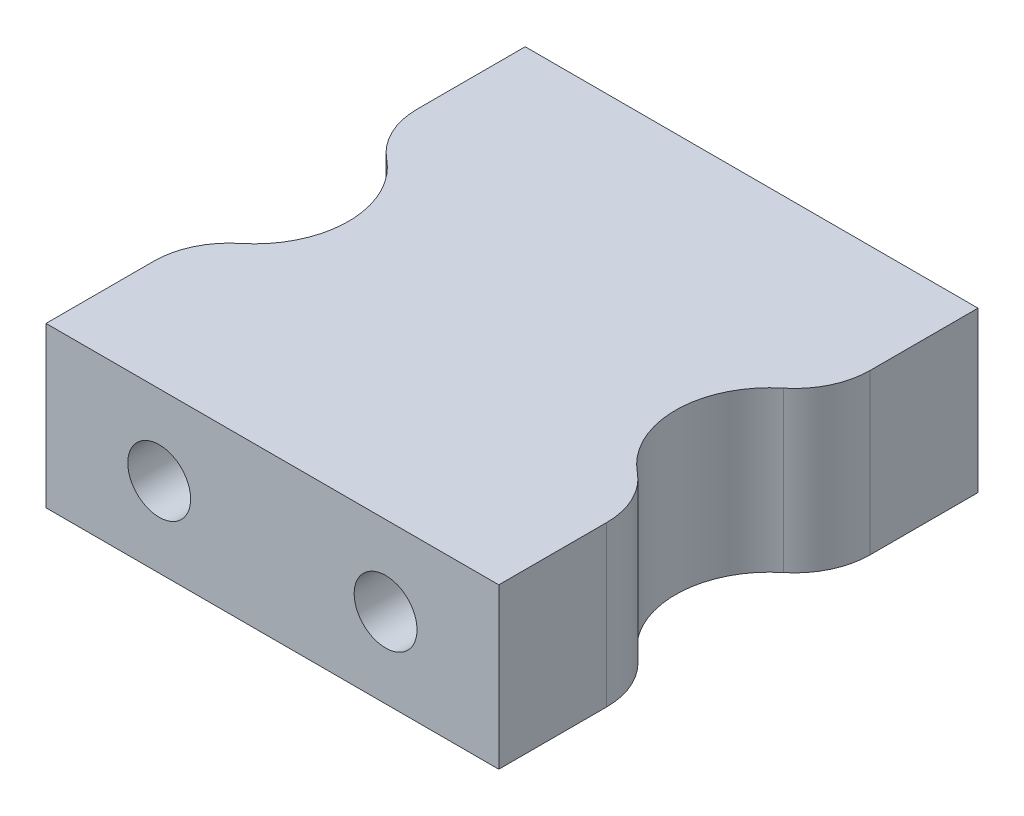
ISO-10303-21;
HEADER;
FILE_DESCRIPTION(('STEP AP214'),'2;1');
FILE_NAME('part.step','',(''),(''),'','','');
FILE_SCHEMA(('AUTOMOTIVE_DESIGN { 1 0 10303 214 1 1 1 1 }'));
ENDSEC;
DATA;
#1=APPLICATION_CONTEXT('core data for automotive mechanical design processes');
#2=APPLICATION_PROTOCOL_DEFINITION('international standard','automotive_design',2000,#1);
#3=PRODUCT_CONTEXT('',#1,'mechanical');
#4=PRODUCT('Part','Part','',(#3));
#5=PRODUCT_RELATED_PRODUCT_CATEGORY('part','',(#4));
#6=PRODUCT_DEFINITION_FORMATION('','',#4);
#7=PRODUCT_DEFINITION_CONTEXT('part definition',#1,'design');
#8=PRODUCT_DEFINITION('design','',#6,#7);
#9=PRODUCT_DEFINITION_SHAPE('','',#8);
#10=(LENGTH_UNIT() NAMED_UNIT(*) SI_UNIT(.MILLI.,.METRE.));
#11=(NAMED_UNIT(*) PLANE_ANGLE_UNIT() SI_UNIT($,.RADIAN.));
#12=(NAMED_UNIT(*) SI_UNIT($,.STERADIAN.) SOLID_ANGLE_UNIT());
#13=UNCERTAINTY_MEASURE_WITH_UNIT(LENGTH_MEASURE(1.E-05),#10,'distance_accuracy_value','');
#14=(GEOMETRIC_REPRESENTATION_CONTEXT(3) GLOBAL_UNCERTAINTY_ASSIGNED_CONTEXT((#13)) GLOBAL_UNIT_ASSIGNED_CONTEXT((#10,
#11,#12)) REPRESENTATION_CONTEXT('',''));
#15=CARTESIAN_POINT('',(0.,0.,0.));
#16=DIRECTION('',(0.,0.,1.));
#17=DIRECTION('',(1.,0.,0.));
#18=AXIS2_PLACEMENT_3D('',#15,#16,#17);
#19=CARTESIAN_POINT('',(0.,0.,19.05));
#20=DIRECTION('',(1.,0.,0.));
#21=DIRECTION('',(0.,1.,0.));
#22=AXIS2_PLACEMENT_3D('',#19,#20,#21);
#23=PLANE('',#22);
#24=DIRECTION('',(0.,0.,-1.));
#25=VECTOR('',#24,1.);
#26=CARTESIAN_POINT('',(0.,0.,19.05));
#27=LINE('',#26,#25);
#28=CARTESIAN_POINT('',(0.,0.,4.28805193839007));
#29=VERTEX_POINT('',#28);
#30=CARTESIAN_POINT('',(0.,0.,0.));
#31=VERTEX_POINT('',#30);
#32=EDGE_CURVE('E169',#29,#31,#27,.T.);
#33=ORIENTED_EDGE('',*,*,#32,.F.);
#34=DIRECTION('',(0.,1.,0.));
#35=VECTOR('',#34,1.);
#36=CARTESIAN_POINT('',(0.,0.,4.28805193839007));
#37=LINE('',#36,#35);
#38=CARTESIAN_POINT('',(0.,6.35,4.28805193839007));
#39=VERTEX_POINT('',#38);
#40=EDGE_CURVE('E11',#29,#39,#37,.T.);
#41=ORIENTED_EDGE('',*,*,#40,.T.);
#42=DIRECTION('',(0.,0.,-1.));
#43=VECTOR('',#42,1.);
#44=CARTESIAN_POINT('',(0.,6.35,19.05));
#45=LINE('',#44,#43);
#46=CARTESIAN_POINT('',(0.,6.35,0.));
#47=VERTEX_POINT('',#46);
#48=EDGE_CURVE('E243',#39,#47,#45,.T.);
#49=ORIENTED_EDGE('',*,*,#48,.T.);
#50=DIRECTION('',(0.,-1.,0.));
#51=VECTOR('',#50,1.);
#52=CARTESIAN_POINT('',(0.,0.,0.));
#53=LINE('',#52,#51);
#54=EDGE_CURVE('E244',#47,#31,#53,.T.);
#55=ORIENTED_EDGE('',*,*,#54,.T.);
#56=EDGE_LOOP('',(#33,#41,#49,#55));
#57=FACE_BOUND('',#56,.T.);
#58=ADVANCED_FACE('F49',(#57),#23,.F.);
#59=CARTESIAN_POINT('',(18.,0.,19.05));
#60=DIRECTION('',(-1.,0.,0.));
#61=DIRECTION('',(0.,0.,1.));
#62=AXIS2_PLACEMENT_3D('',#59,#60,#61);
#63=PLANE('',#62);
#64=DIRECTION('',(0.,0.,-1.));
#65=VECTOR('',#64,1.);
#66=CARTESIAN_POINT('',(18.,0.,19.05));
#67=LINE('',#66,#65);
#68=CARTESIAN_POINT('',(18.,0.,19.05));
#69=VERTEX_POINT('',#68);
#70=CARTESIAN_POINT('',(18.,0.,14.7619480616099));
#71=VERTEX_POINT('',#70);
#72=EDGE_CURVE('E148',#69,#71,#67,.T.);
#73=ORIENTED_EDGE('',*,*,#72,.T.);
#74=DIRECTION('',(0.,1.,0.));
#75=VECTOR('',#74,1.);
#76=CARTESIAN_POINT('',(18.,0.,14.7619480616099));
#77=LINE('',#76,#75);
#78=CARTESIAN_POINT('',(18.,6.35,14.7619480616099));
#79=VERTEX_POINT('',#78);
#80=EDGE_CURVE('E168',#71,#79,#77,.T.);
#81=ORIENTED_EDGE('',*,*,#80,.T.);
#82=DIRECTION('',(0.,0.,-1.));
#83=VECTOR('',#82,1.);
#84=CARTESIAN_POINT('',(18.,6.35,19.05));
#85=LINE('',#84,#83);
#86=CARTESIAN_POINT('',(18.,6.35,19.05));
#87=VERTEX_POINT('',#86);
#88=EDGE_CURVE('E262',#87,#79,#85,.T.);
#89=ORIENTED_EDGE('',*,*,#88,.F.);
#90=DIRECTION('',(0.,1.,0.));
#91=VECTOR('',#90,1.);
#92=CARTESIAN_POINT('',(18.,0.,19.05));
#93=LINE('',#92,#91);
#94=EDGE_CURVE('E152',#69,#87,#93,.T.);
#95=ORIENTED_EDGE('',*,*,#94,.F.);
#96=EDGE_LOOP('',(#73,#81,#89,#95));
#97=FACE_BOUND('',#96,.T.);
#98=ADVANCED_FACE('F338',(#97),#63,.F.);
#99=CARTESIAN_POINT('',(0.,6.35,19.05));
#100=VERTEX_POINT('',#99);
#101=CARTESIAN_POINT('',(0.,6.35,14.7619480616099));
#102=VERTEX_POINT('',#101);
#103=EDGE_CURVE('E259',#100,#102,#45,.T.);
#104=ORIENTED_EDGE('',*,*,#103,.T.);
#105=DIRECTION('',(0.,1.,0.));
#106=VECTOR('',#105,1.);
#107=CARTESIAN_POINT('',(0.,0.,14.7619480616099));
#108=LINE('',#107,#106);
#109=CARTESIAN_POINT('',(0.,0.,14.7619480616099));
#110=VERTEX_POINT('',#109);
#111=EDGE_CURVE('E58',#102,#110,#108,.F.);
#112=ORIENTED_EDGE('',*,*,#111,.T.);
#113=CARTESIAN_POINT('',(0.,0.,19.05));
#114=VERTEX_POINT('',#113);
#115=EDGE_CURVE('E145',#114,#110,#27,.T.);
#116=ORIENTED_EDGE('',*,*,#115,.F.);
#117=DIRECTION('',(0.,-1.,0.));
#118=VECTOR('',#117,1.);
#119=CARTESIAN_POINT('',(0.,0.,19.05));
#120=LINE('',#119,#118);
#121=EDGE_CURVE('E153',#100,#114,#120,.T.);
#122=ORIENTED_EDGE('',*,*,#121,.F.);
#123=EDGE_LOOP('',(#104,#112,#116,#122));
#124=FACE_BOUND('',#123,.T.);
#125=ADVANCED_FACE('F165',(#124),#23,.F.);
#126=CARTESIAN_POINT('',(0.,0.,19.05));
#127=DIRECTION('',(0.,1.,0.));
#128=DIRECTION('',(0.,0.,1.));
#129=AXIS2_PLACEMENT_3D('',#126,#127,#128);
#130=PLANE('',#129);
#131=CARTESIAN_POINT('',(19.235125,0.,9.525));
#132=DIRECTION('',(0.,1.,0.));
#133=DIRECTION('',(1.,0.,0.));
#134=AXIS2_PLACEMENT_3D('',#131,#132,#133);
#135=CIRCLE('',#134,3.735125);
#136=CARTESIAN_POINT('',(16.8864349214009,0.,6.62072493032857));
#137=VERTEX_POINT('',#136);
#138=CARTESIAN_POINT('',(16.8864349214009,0.,12.4292750696714));
#139=VERTEX_POINT('',#138);
#140=EDGE_CURVE('E233',#137,#139,#135,.T.);
#141=ORIENTED_EDGE('',*,*,#140,.T.);
#142=CARTESIAN_POINT('',(15.,0.,14.7619480616099));
#143=DIRECTION('',(0.,1.,0.));
#144=DIRECTION('',(0.,0.,1.));
#145=AXIS2_PLACEMENT_3D('',#142,#143,#144);
#146=CIRCLE('',#145,3.);
#147=EDGE_CURVE('E205',#139,#71,#146,.F.);
#148=ORIENTED_EDGE('',*,*,#147,.T.);
#149=ORIENTED_EDGE('',*,*,#72,.F.);
#150=DIRECTION('',(1.,0.,0.));
#151=VECTOR('',#150,1.);
#152=CARTESIAN_POINT('',(0.,0.,19.05));
#153=LINE('',#152,#151);
#154=EDGE_CURVE('E140',#114,#69,#153,.T.);
#155=ORIENTED_EDGE('',*,*,#154,.F.);
#156=ORIENTED_EDGE('',*,*,#115,.T.);
#157=CARTESIAN_POINT('',(3.,0.,14.7619480616099));
#158=DIRECTION('',(0.,1.,0.));
#159=DIRECTION('',(0.,0.,1.));
#160=AXIS2_PLACEMENT_3D('',#157,#158,#159);
#161=CIRCLE('',#160,3.);
#162=CARTESIAN_POINT('',(1.11356507859914,0.,12.4292750696714));
#163=VERTEX_POINT('',#162);
#164=EDGE_CURVE('E199',#110,#163,#161,.F.);
#165=ORIENTED_EDGE('',*,*,#164,.T.);
#166=CARTESIAN_POINT('',(-1.235125,0.,9.525));
#167=DIRECTION('',(0.,1.,0.));
#168=DIRECTION('',(-1.,0.,0.));
#169=AXIS2_PLACEMENT_3D('',#166,#167,#168);
#170=CIRCLE('',#169,3.735125);
#171=CARTESIAN_POINT('',(1.11356507859914,0.,6.62072493032857));
#172=VERTEX_POINT('',#171);
#173=EDGE_CURVE('E221',#163,#172,#170,.T.);
#174=ORIENTED_EDGE('',*,*,#173,.T.);
#175=CARTESIAN_POINT('',(3.,0.,4.28805193839007));
#176=DIRECTION('',(0.,1.,0.));
#177=DIRECTION('',(0.,0.,1.));
#178=AXIS2_PLACEMENT_3D('',#175,#176,#177);
#179=CIRCLE('',#178,3.);
#180=EDGE_CURVE('E65',#172,#29,#179,.F.);
#181=ORIENTED_EDGE('',*,*,#180,.T.);
#182=ORIENTED_EDGE('',*,*,#32,.T.);
#183=DIRECTION('',(1.,0.,0.));
#184=VECTOR('',#183,1.);
#185=CARTESIAN_POINT('',(0.,0.,0.));
#186=LINE('',#185,#184);
#187=CARTESIAN_POINT('',(18.,0.,0.));
#188=VERTEX_POINT('',#187);
#189=EDGE_CURVE('E248',#31,#188,#186,.T.);
#190=ORIENTED_EDGE('',*,*,#189,.T.);
#191=CARTESIAN_POINT('',(18.,0.,4.28805193839007));
#192=VERTEX_POINT('',#191);
#193=EDGE_CURVE('E264',#192,#188,#67,.T.);
#194=ORIENTED_EDGE('',*,*,#193,.F.);
#195=CARTESIAN_POINT('',(15.,0.,4.28805193839007));
#196=DIRECTION('',(0.,1.,0.));
#197=DIRECTION('',(0.,0.,1.));
#198=AXIS2_PLACEMENT_3D('',#195,#196,#197);
#199=CIRCLE('',#198,3.);
#200=EDGE_CURVE('E202',#192,#137,#199,.F.);
#201=ORIENTED_EDGE('',*,*,#200,.T.);
#202=EDGE_LOOP('',(#141,#148,#149,#155,#156,#165,#174,#181,#182,#190,#194,#201));
#203=FACE_BOUND('',#202,.T.);
#204=ADVANCED_FACE('F143',(#203),#130,.F.);
#205=CARTESIAN_POINT('',(18.,6.35,4.28805193839007));
#206=VERTEX_POINT('',#205);
#207=CARTESIAN_POINT('',(18.,6.35,0.));
#208=VERTEX_POINT('',#207);
#209=EDGE_CURVE('E261',#206,#208,#85,.T.);
#210=ORIENTED_EDGE('',*,*,#209,.F.);
#211=DIRECTION('',(0.,1.,0.));
#212=VECTOR('',#211,1.);
#213=CARTESIAN_POINT('',(18.,0.,4.28805193839007));
#214=LINE('',#213,#212);
#215=EDGE_CURVE('E208',#206,#192,#214,.F.);
#216=ORIENTED_EDGE('',*,*,#215,.T.);
#217=ORIENTED_EDGE('',*,*,#193,.T.);
#218=DIRECTION('',(0.,1.,0.));
#219=VECTOR('',#218,1.);
#220=CARTESIAN_POINT('',(18.,0.,0.));
#221=LINE('',#220,#219);
#222=EDGE_CURVE('E252',#188,#208,#221,.T.);
#223=ORIENTED_EDGE('',*,*,#222,.T.);
#224=EDGE_LOOP('',(#210,#216,#217,#223));
#225=FACE_BOUND('',#224,.T.);
#226=ADVANCED_FACE('F275',(#225),#63,.F.);
#227=CARTESIAN_POINT('',(0.,6.35,19.05));
#228=DIRECTION('',(0.,-1.,0.));
#229=DIRECTION('',(0.,0.,-1.));
#230=AXIS2_PLACEMENT_3D('',#227,#228,#229);
#231=PLANE('',#230);
#232=ORIENTED_EDGE('',*,*,#88,.T.);
#233=CARTESIAN_POINT('',(15.,6.35,14.7619480616099));
#234=DIRECTION('',(0.,-1.,0.));
#235=DIRECTION('',(0.,0.,-1.));
#236=AXIS2_PLACEMENT_3D('',#233,#234,#235);
#237=CIRCLE('',#236,3.);
#238=CARTESIAN_POINT('',(16.8864349214009,6.35,12.4292750696714));
#239=VERTEX_POINT('',#238);
#240=EDGE_CURVE('E187',#79,#239,#237,.F.);
#241=ORIENTED_EDGE('',*,*,#240,.T.);
#242=CARTESIAN_POINT('',(19.235125,6.35,9.525));
#243=DIRECTION('',(0.,1.,0.));
#244=DIRECTION('',(1.,0.,0.));
#245=AXIS2_PLACEMENT_3D('',#242,#243,#244);
#246=CIRCLE('',#245,3.735125);
#247=CARTESIAN_POINT('',(16.8864349214009,6.35,6.62072493032857));
#248=VERTEX_POINT('',#247);
#249=EDGE_CURVE('E228',#248,#239,#246,.T.);
#250=ORIENTED_EDGE('',*,*,#249,.F.);
#251=CARTESIAN_POINT('',(15.,6.35,4.28805193839007));
#252=DIRECTION('',(0.,-1.,0.));
#253=DIRECTION('',(0.,0.,-1.));
#254=AXIS2_PLACEMENT_3D('',#251,#252,#253);
#255=CIRCLE('',#254,3.);
#256=EDGE_CURVE('E184',#248,#206,#255,.F.);
#257=ORIENTED_EDGE('',*,*,#256,.T.);
#258=ORIENTED_EDGE('',*,*,#209,.T.);
#259=DIRECTION('',(-1.,0.,0.));
#260=VECTOR('',#259,1.);
#261=CARTESIAN_POINT('',(0.,6.35,0.));
#262=LINE('',#261,#260);
#263=EDGE_CURVE('E163',#208,#47,#262,.T.);
#264=ORIENTED_EDGE('',*,*,#263,.T.);
#265=ORIENTED_EDGE('',*,*,#48,.F.);
#266=CARTESIAN_POINT('',(3.,6.35,4.28805193839007));
#267=DIRECTION('',(0.,-1.,0.));
#268=DIRECTION('',(0.,0.,-1.));
#269=AXIS2_PLACEMENT_3D('',#266,#267,#268);
#270=CIRCLE('',#269,3.);
#271=CARTESIAN_POINT('',(1.11356507859914,6.35,6.62072493032857));
#272=VERTEX_POINT('',#271);
#273=EDGE_CURVE('E174',#39,#272,#270,.F.);
#274=ORIENTED_EDGE('',*,*,#273,.T.);
#275=CARTESIAN_POINT('',(-1.235125,6.35,9.525));
#276=DIRECTION('',(0.,1.,0.));
#277=DIRECTION('',(-1.,0.,0.));
#278=AXIS2_PLACEMENT_3D('',#275,#276,#277);
#279=CIRCLE('',#278,3.735125);
#280=CARTESIAN_POINT('',(1.11356507859914,6.35,12.4292750696714));
#281=VERTEX_POINT('',#280);
#282=EDGE_CURVE('E220',#281,#272,#279,.T.);
#283=ORIENTED_EDGE('',*,*,#282,.F.);
#284=CARTESIAN_POINT('',(3.,6.35,14.7619480616099));
#285=DIRECTION('',(0.,-1.,0.));
#286=DIRECTION('',(0.,0.,-1.));
#287=AXIS2_PLACEMENT_3D('',#284,#285,#286);
#288=CIRCLE('',#287,3.);
#289=EDGE_CURVE('E181',#281,#102,#288,.F.);
#290=ORIENTED_EDGE('',*,*,#289,.T.);
#291=ORIENTED_EDGE('',*,*,#103,.F.);
#292=DIRECTION('',(-1.,0.,0.));
#293=VECTOR('',#292,1.);
#294=CARTESIAN_POINT('',(0.,6.35,19.05));
#295=LINE('',#294,#293);
#296=EDGE_CURVE('E158',#87,#100,#295,.T.);
#297=ORIENTED_EDGE('',*,*,#296,.F.);
#298=EDGE_LOOP('',(#232,#241,#250,#257,#258,#264,#265,#274,#283,#290,#291,#297));
#299=FACE_BOUND('',#298,.T.);
#300=ADVANCED_FACE('F225',(#299),#231,.F.);
#301=CARTESIAN_POINT('',(0.,0.,19.05));
#302=DIRECTION('',(0.,0.,-1.));
#303=DIRECTION('',(-1.,0.,0.));
#304=AXIS2_PLACEMENT_3D('',#301,#302,#303);
#305=PLANE('',#304);
#306=CARTESIAN_POINT('',(13.5,3.175,19.05));
#307=DIRECTION('',(0.,0.,-1.));
#308=DIRECTION('',(-1.,0.,0.));
#309=AXIS2_PLACEMENT_3D('',#306,#307,#308);
#310=CIRCLE('',#309,1.25);
#311=CARTESIAN_POINT('',(12.25,3.175,19.05));
#312=VERTEX_POINT('',#311);
#313=EDGE_CURVE('E311',#312,#312,#310,.T.);
#314=ORIENTED_EDGE('',*,*,#313,.T.);
#315=EDGE_LOOP('',(#314));
#316=FACE_BOUND('',#315,.T.);
#317=CARTESIAN_POINT('',(4.5,3.175,19.05));
#318=DIRECTION('',(0.,0.,-1.));
#319=DIRECTION('',(-1.,0.,0.));
#320=AXIS2_PLACEMENT_3D('',#317,#318,#319);
#321=CIRCLE('',#320,1.25);
#322=CARTESIAN_POINT('',(3.25,3.175,19.05));
#323=VERTEX_POINT('',#322);
#324=EDGE_CURVE('E303',#323,#323,#321,.T.);
#325=ORIENTED_EDGE('',*,*,#324,.T.);
#326=EDGE_LOOP('',(#325));
#327=FACE_BOUND('',#326,.T.);
#328=ORIENTED_EDGE('',*,*,#121,.T.);
#329=ORIENTED_EDGE('',*,*,#154,.T.);
#330=ORIENTED_EDGE('',*,*,#94,.T.);
#331=ORIENTED_EDGE('',*,*,#296,.T.);
#332=EDGE_LOOP('',(#328,#329,#330,#331));
#333=FACE_BOUND('',#332,.T.);
#334=ADVANCED_FACE('F156',(#316,#327,#333),#305,.F.);
#335=CARTESIAN_POINT('',(0.,0.,0.));
#336=DIRECTION('',(0.,0.,-1.));
#337=DIRECTION('',(-1.,0.,0.));
#338=AXIS2_PLACEMENT_3D('',#335,#336,#337);
#339=PLANE('',#338);
#340=CARTESIAN_POINT('',(13.5,3.175,0.));
#341=DIRECTION('',(0.,0.,-1.));
#342=DIRECTION('',(-1.,0.,0.));
#343=AXIS2_PLACEMENT_3D('',#340,#341,#342);
#344=CIRCLE('',#343,1.25);
#345=CARTESIAN_POINT('',(12.25,3.175,0.));
#346=VERTEX_POINT('',#345);
#347=EDGE_CURVE('E296',#346,#346,#344,.T.);
#348=ORIENTED_EDGE('',*,*,#347,.F.);
#349=EDGE_LOOP('',(#348));
#350=FACE_BOUND('',#349,.T.);
#351=CARTESIAN_POINT('',(4.5,3.175,0.));
#352=DIRECTION('',(0.,0.,-1.));
#353=DIRECTION('',(-1.,0.,0.));
#354=AXIS2_PLACEMENT_3D('',#351,#352,#353);
#355=CIRCLE('',#354,1.25);
#356=CARTESIAN_POINT('',(3.25,3.175,0.));
#357=VERTEX_POINT('',#356);
#358=EDGE_CURVE('E291',#357,#357,#355,.T.);
#359=ORIENTED_EDGE('',*,*,#358,.F.);
#360=EDGE_LOOP('',(#359));
#361=FACE_BOUND('',#360,.T.);
#362=ORIENTED_EDGE('',*,*,#54,.F.);
#363=ORIENTED_EDGE('',*,*,#263,.F.);
#364=ORIENTED_EDGE('',*,*,#222,.F.);
#365=ORIENTED_EDGE('',*,*,#189,.F.);
#366=EDGE_LOOP('',(#362,#363,#364,#365));
#367=FACE_BOUND('',#366,.T.);
#368=ADVANCED_FACE('F279',(#350,#361,#367),#339,.T.);
#369=CARTESIAN_POINT('',(-1.235125,0.,9.525));
#370=DIRECTION('',(0.,1.,0.));
#371=DIRECTION('',(-1.,0.,0.));
#372=AXIS2_PLACEMENT_3D('',#369,#370,#371);
#373=CYLINDRICAL_SURFACE('',#372,3.735125);
#374=ORIENTED_EDGE('',*,*,#173,.F.);
#375=DIRECTION('',(0.,1.,0.));
#376=VECTOR('',#375,1.);
#377=CARTESIAN_POINT('',(1.11356507859914,0.,12.4292750696714));
#378=LINE('',#377,#376);
#379=EDGE_CURVE('E213',#163,#281,#378,.T.);
#380=ORIENTED_EDGE('',*,*,#379,.T.);
#381=ORIENTED_EDGE('',*,*,#282,.T.);
#382=DIRECTION('',(0.,1.,0.));
#383=VECTOR('',#382,1.);
#384=CARTESIAN_POINT('',(1.11356507859914,0.,6.62072493032857));
#385=LINE('',#384,#383);
#386=EDGE_CURVE('E73',#272,#172,#385,.F.);
#387=ORIENTED_EDGE('',*,*,#386,.T.);
#388=EDGE_LOOP('',(#374,#380,#381,#387));
#389=FACE_BOUND('',#388,.T.);
#390=ADVANCED_FACE('F219',(#389),#373,.F.);
#391=CARTESIAN_POINT('',(19.235125,0.,9.525));
#392=DIRECTION('',(0.,1.,0.));
#393=DIRECTION('',(-1.,0.,0.));
#394=AXIS2_PLACEMENT_3D('',#391,#392,#393);
#395=CYLINDRICAL_SURFACE('',#394,3.735125);
#396=ORIENTED_EDGE('',*,*,#249,.T.);
#397=DIRECTION('',(0.,1.,0.));
#398=VECTOR('',#397,1.);
#399=CARTESIAN_POINT('',(16.8864349214009,0.,12.4292750696714));
#400=LINE('',#399,#398);
#401=EDGE_CURVE('E194',#239,#139,#400,.F.);
#402=ORIENTED_EDGE('',*,*,#401,.T.);
#403=ORIENTED_EDGE('',*,*,#140,.F.);
#404=DIRECTION('',(0.,1.,0.));
#405=VECTOR('',#404,1.);
#406=CARTESIAN_POINT('',(16.8864349214009,0.,6.62072493032857));
#407=LINE('',#406,#405);
#408=EDGE_CURVE('E190',#137,#248,#407,.T.);
#409=ORIENTED_EDGE('',*,*,#408,.T.);
#410=EDGE_LOOP('',(#396,#402,#403,#409));
#411=FACE_BOUND('',#410,.T.);
#412=ADVANCED_FACE('F364',(#411),#395,.F.);
#413=CARTESIAN_POINT('',(4.5,3.175,5.));
#414=DIRECTION('',(0.,0.,-1.));
#415=DIRECTION('',(-1.,0.,0.));
#416=AXIS2_PLACEMENT_3D('',#413,#414,#415);
#417=CYLINDRICAL_SURFACE('',#416,1.25);
#418=CARTESIAN_POINT('',(4.5,3.175,5.));
#419=DIRECTION('',(0.,0.,-1.));
#420=DIRECTION('',(-1.,0.,0.));
#421=AXIS2_PLACEMENT_3D('',#418,#419,#420);
#422=CIRCLE('',#421,1.25);
#423=CARTESIAN_POINT('',(3.25,3.175,5.));
#424=VERTEX_POINT('',#423);
#425=EDGE_CURVE('E287',#424,#424,#422,.T.);
#426=ORIENTED_EDGE('',*,*,#425,.F.);
#427=EDGE_LOOP('',(#426));
#428=FACE_BOUND('',#427,.T.);
#429=ORIENTED_EDGE('',*,*,#358,.T.);
#430=EDGE_LOOP('',(#429));
#431=FACE_BOUND('',#430,.T.);
#432=ADVANCED_FACE('F367',(#428,#431),#417,.F.);
#433=CARTESIAN_POINT('',(4.5,3.175,5.));
#434=DIRECTION('',(0.,0.,-1.));
#435=DIRECTION('',(-1.,0.,0.));
#436=AXIS2_PLACEMENT_3D('',#433,#434,#435);
#437=PLANE('',#436);
#438=ORIENTED_EDGE('',*,*,#425,.T.);
#439=EDGE_LOOP('',(#438));
#440=FACE_BOUND('',#439,.T.);
#441=ADVANCED_FACE('F369',(#440),#437,.T.);
#442=CARTESIAN_POINT('',(13.5,3.175,5.));
#443=DIRECTION('',(0.,0.,-1.));
#444=DIRECTION('',(-1.,0.,0.));
#445=AXIS2_PLACEMENT_3D('',#442,#443,#444);
#446=CYLINDRICAL_SURFACE('',#445,1.25);
#447=CARTESIAN_POINT('',(13.5,3.175,5.));
#448=DIRECTION('',(0.,0.,-1.));
#449=DIRECTION('',(-1.,0.,0.));
#450=AXIS2_PLACEMENT_3D('',#447,#448,#449);
#451=CIRCLE('',#450,1.25);
#452=CARTESIAN_POINT('',(12.25,3.175,5.));
#453=VERTEX_POINT('',#452);
#454=EDGE_CURVE('E235',#453,#453,#451,.T.);
#455=ORIENTED_EDGE('',*,*,#454,.F.);
#456=EDGE_LOOP('',(#455));
#457=FACE_BOUND('',#456,.T.);
#458=ORIENTED_EDGE('',*,*,#347,.T.);
#459=EDGE_LOOP('',(#458));
#460=FACE_BOUND('',#459,.T.);
#461=ADVANCED_FACE('F372',(#457,#460),#446,.F.);
#462=CARTESIAN_POINT('',(13.5,3.175,5.));
#463=DIRECTION('',(0.,0.,-1.));
#464=DIRECTION('',(-1.,0.,0.));
#465=AXIS2_PLACEMENT_3D('',#462,#463,#464);
#466=PLANE('',#465);
#467=ORIENTED_EDGE('',*,*,#454,.T.);
#468=EDGE_LOOP('',(#467));
#469=FACE_BOUND('',#468,.T.);
#470=ADVANCED_FACE('F379',(#469),#466,.T.);
#471=CARTESIAN_POINT('',(4.5,3.175,14.05));
#472=DIRECTION('',(0.,0.,1.));
#473=DIRECTION('',(1.,0.,0.));
#474=AXIS2_PLACEMENT_3D('',#471,#472,#473);
#475=CYLINDRICAL_SURFACE('',#474,1.25);
#476=CARTESIAN_POINT('',(4.5,3.175,14.05));
#477=DIRECTION('',(0.,0.,-1.));
#478=DIRECTION('',(-1.,0.,0.));
#479=AXIS2_PLACEMENT_3D('',#476,#477,#478);
#480=CIRCLE('',#479,1.25);
#481=CARTESIAN_POINT('',(3.25,3.175,14.05));
#482=VERTEX_POINT('',#481);
#483=EDGE_CURVE('E307',#482,#482,#480,.T.);
#484=ORIENTED_EDGE('',*,*,#483,.T.);
#485=EDGE_LOOP('',(#484));
#486=FACE_BOUND('',#485,.T.);
#487=ORIENTED_EDGE('',*,*,#324,.F.);
#488=EDGE_LOOP('',(#487));
#489=FACE_BOUND('',#488,.T.);
#490=ADVANCED_FACE('F383',(#486,#489),#475,.F.);
#491=CARTESIAN_POINT('',(4.5,3.175,14.05));
#492=DIRECTION('',(0.,0.,1.));
#493=DIRECTION('',(-1.,0.,0.));
#494=AXIS2_PLACEMENT_3D('',#491,#492,#493);
#495=PLANE('',#494);
#496=ORIENTED_EDGE('',*,*,#483,.F.);
#497=EDGE_LOOP('',(#496));
#498=FACE_BOUND('',#497,.T.);
#499=ADVANCED_FACE('F335',(#498),#495,.T.);
#500=CARTESIAN_POINT('',(13.5,3.175,14.05));
#501=DIRECTION('',(0.,0.,1.));
#502=DIRECTION('',(1.,0.,0.));
#503=AXIS2_PLACEMENT_3D('',#500,#501,#502);
#504=CYLINDRICAL_SURFACE('',#503,1.25);
#505=CARTESIAN_POINT('',(13.5,3.175,14.05));
#506=DIRECTION('',(0.,0.,-1.));
#507=DIRECTION('',(-1.,0.,0.));
#508=AXIS2_PLACEMENT_3D('',#505,#506,#507);
#509=CIRCLE('',#508,1.25);
#510=CARTESIAN_POINT('',(12.25,3.175,14.05));
#511=VERTEX_POINT('',#510);
#512=EDGE_CURVE('E292',#511,#511,#509,.T.);
#513=ORIENTED_EDGE('',*,*,#512,.T.);
#514=EDGE_LOOP('',(#513));
#515=FACE_BOUND('',#514,.T.);
#516=ORIENTED_EDGE('',*,*,#313,.F.);
#517=EDGE_LOOP('',(#516));
#518=FACE_BOUND('',#517,.T.);
#519=ADVANCED_FACE('F319',(#515,#518),#504,.F.);
#520=CARTESIAN_POINT('',(13.5,3.175,14.05));
#521=DIRECTION('',(0.,0.,1.));
#522=DIRECTION('',(-1.,0.,0.));
#523=AXIS2_PLACEMENT_3D('',#520,#521,#522);
#524=PLANE('',#523);
#525=ORIENTED_EDGE('',*,*,#512,.F.);
#526=EDGE_LOOP('',(#525));
#527=FACE_BOUND('',#526,.T.);
#528=ADVANCED_FACE('F322',(#527),#524,.T.);
#529=CARTESIAN_POINT('',(15.,0.,14.7619480616099));
#530=DIRECTION('',(0.,1.,0.));
#531=DIRECTION('',(-1.,0.,0.));
#532=AXIS2_PLACEMENT_3D('',#529,#530,#531);
#533=CYLINDRICAL_SURFACE('',#532,3.);
#534=ORIENTED_EDGE('',*,*,#147,.F.);
#535=ORIENTED_EDGE('',*,*,#401,.F.);
#536=ORIENTED_EDGE('',*,*,#240,.F.);
#537=ORIENTED_EDGE('',*,*,#80,.F.);
#538=EDGE_LOOP('',(#534,#535,#536,#537));
#539=FACE_BOUND('',#538,.T.);
#540=ADVANCED_FACE('F324',(#539),#533,.T.);
#541=CARTESIAN_POINT('',(15.,0.,4.28805193839007));
#542=DIRECTION('',(0.,1.,0.));
#543=DIRECTION('',(-1.,0.,0.));
#544=AXIS2_PLACEMENT_3D('',#541,#542,#543);
#545=CYLINDRICAL_SURFACE('',#544,3.);
#546=ORIENTED_EDGE('',*,*,#200,.F.);
#547=ORIENTED_EDGE('',*,*,#215,.F.);
#548=ORIENTED_EDGE('',*,*,#256,.F.);
#549=ORIENTED_EDGE('',*,*,#408,.F.);
#550=EDGE_LOOP('',(#546,#547,#548,#549));
#551=FACE_BOUND('',#550,.T.);
#552=ADVANCED_FACE('F331',(#551),#545,.T.);
#553=CARTESIAN_POINT('',(3.,0.,14.7619480616099));
#554=DIRECTION('',(0.,1.,0.));
#555=DIRECTION('',(-1.,0.,0.));
#556=AXIS2_PLACEMENT_3D('',#553,#554,#555);
#557=CYLINDRICAL_SURFACE('',#556,3.);
#558=ORIENTED_EDGE('',*,*,#164,.F.);
#559=ORIENTED_EDGE('',*,*,#111,.F.);
#560=ORIENTED_EDGE('',*,*,#289,.F.);
#561=ORIENTED_EDGE('',*,*,#379,.F.);
#562=EDGE_LOOP('',(#558,#559,#560,#561));
#563=FACE_BOUND('',#562,.T.);
#564=ADVANCED_FACE('F426',(#563),#557,.T.);
#565=CARTESIAN_POINT('',(3.,0.,4.28805193839007));
#566=DIRECTION('',(0.,1.,0.));
#567=DIRECTION('',(-1.,0.,0.));
#568=AXIS2_PLACEMENT_3D('',#565,#566,#567);
#569=CYLINDRICAL_SURFACE('',#568,3.);
#570=ORIENTED_EDGE('',*,*,#180,.F.);
#571=ORIENTED_EDGE('',*,*,#386,.F.);
#572=ORIENTED_EDGE('',*,*,#273,.F.);
#573=ORIENTED_EDGE('',*,*,#40,.F.);
#574=EDGE_LOOP('',(#570,#571,#572,#573));
#575=FACE_BOUND('',#574,.T.);
#576=ADVANCED_FACE('F51',(#575),#569,.T.);
#577=CLOSED_SHELL('',(#58,#98,#125,#204,#226,#300,#334,#368,#390,#412,#432,#441,#461,#470,#490,
#499,#519,#528,#540,#552,#564,#576));
#578=MANIFOLD_SOLID_BREP('B2',#577);
#579=ADVANCED_BREP_SHAPE_REPRESENTATION('',(#18,#578),#14);
#580=SHAPE_DEFINITION_REPRESENTATION(#9,#579);
ENDSEC;
END-ISO-10303-21;
